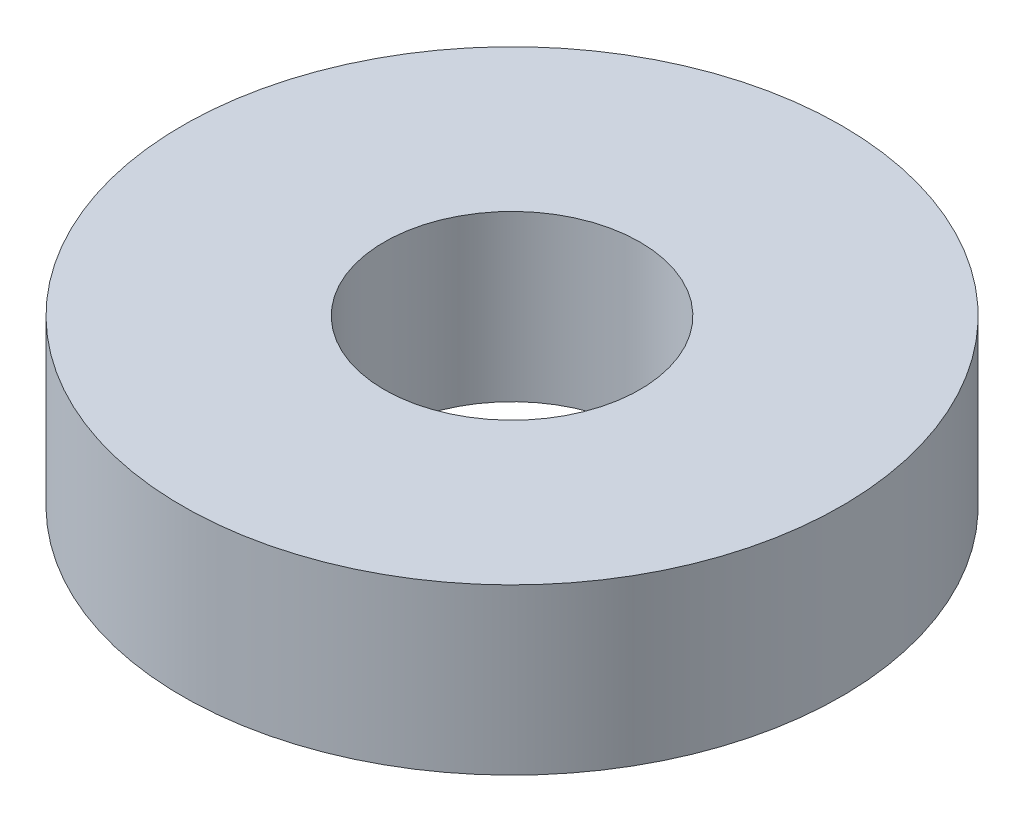
ISO-10303-21;
HEADER;
FILE_DESCRIPTION(('STEP AP214'),'2;1');
FILE_NAME('part.step','',(''),(''),'','','');
FILE_SCHEMA(('AUTOMOTIVE_DESIGN { 1 0 10303 214 1 1 1 1 }'));
ENDSEC;
DATA;
#1=APPLICATION_CONTEXT('core data for automotive mechanical design processes');
#2=APPLICATION_PROTOCOL_DEFINITION('international standard','automotive_design',2000,#1);
#3=PRODUCT_CONTEXT('',#1,'mechanical');
#4=PRODUCT('Part','Part','',(#3));
#5=PRODUCT_RELATED_PRODUCT_CATEGORY('part','',(#4));
#6=PRODUCT_DEFINITION_FORMATION('','',#4);
#7=PRODUCT_DEFINITION_CONTEXT('part definition',#1,'design');
#8=PRODUCT_DEFINITION('design','',#6,#7);
#9=PRODUCT_DEFINITION_SHAPE('','',#8);
#10=(LENGTH_UNIT() NAMED_UNIT(*) SI_UNIT(.MILLI.,.METRE.));
#11=(NAMED_UNIT(*) PLANE_ANGLE_UNIT() SI_UNIT($,.RADIAN.));
#12=(NAMED_UNIT(*) SI_UNIT($,.STERADIAN.) SOLID_ANGLE_UNIT());
#13=UNCERTAINTY_MEASURE_WITH_UNIT(LENGTH_MEASURE(1.E-05),#10,'distance_accuracy_value','');
#14=(GEOMETRIC_REPRESENTATION_CONTEXT(3) GLOBAL_UNCERTAINTY_ASSIGNED_CONTEXT((#13)) GLOBAL_UNIT_ASSIGNED_CONTEXT((#10,
#11,#12)) REPRESENTATION_CONTEXT('',''));
#15=CARTESIAN_POINT('',(0.,0.,0.));
#16=DIRECTION('',(0.,0.,1.));
#17=DIRECTION('',(1.,0.,0.));
#18=AXIS2_PLACEMENT_3D('',#15,#16,#17);
#19=CARTESIAN_POINT('',(0.,-1.5875,0.));
#20=DIRECTION('',(0.,1.,0.));
#21=DIRECTION('',(0.,0.,1.));
#22=AXIS2_PLACEMENT_3D('',#19,#20,#21);
#23=PLANE('',#22);
#24=CARTESIAN_POINT('',(0.,-1.5875,0.));
#25=DIRECTION('',(0.,-1.,0.));
#26=DIRECTION('',(0.,0.,-1.));
#27=AXIS2_PLACEMENT_3D('',#24,#25,#26);
#28=CIRCLE('',#27,2.4638);
#29=CARTESIAN_POINT('',(0.,-1.5875,-2.4638));
#30=VERTEX_POINT('',#29);
#31=EDGE_CURVE('E28',#30,#30,#28,.F.);
#32=ORIENTED_EDGE('',*,*,#31,.T.);
#33=EDGE_LOOP('',(#32));
#34=FACE_BOUND('',#33,.T.);
#35=CARTESIAN_POINT('',(0.,-1.5875,0.));
#36=DIRECTION('',(0.,-1.,0.));
#37=DIRECTION('',(0.,0.,-1.));
#38=AXIS2_PLACEMENT_3D('',#35,#36,#37);
#39=CIRCLE('',#38,6.35);
#40=CARTESIAN_POINT('',(0.,-1.5875,-6.35));
#41=VERTEX_POINT('',#40);
#42=EDGE_CURVE('E19',#41,#41,#39,.F.);
#43=ORIENTED_EDGE('',*,*,#42,.F.);
#44=EDGE_LOOP('',(#43));
#45=FACE_BOUND('',#44,.T.);
#46=ADVANCED_FACE('F16',(#34,#45),#23,.F.);
#47=CARTESIAN_POINT('',(0.,1.5875,0.));
#48=DIRECTION('',(0.,-1.,0.));
#49=DIRECTION('',(0.,0.,-1.));
#50=AXIS2_PLACEMENT_3D('',#47,#48,#49);
#51=CYLINDRICAL_SURFACE('',#50,6.35);
#52=ORIENTED_EDGE('',*,*,#42,.T.);
#53=EDGE_LOOP('',(#52));
#54=FACE_BOUND('',#53,.T.);
#55=CARTESIAN_POINT('',(0.,1.5875,0.));
#56=DIRECTION('',(0.,-1.,0.));
#57=DIRECTION('',(0.,0.,-1.));
#58=AXIS2_PLACEMENT_3D('',#55,#56,#57);
#59=CIRCLE('',#58,6.35);
#60=CARTESIAN_POINT('',(0.,1.5875,-6.35));
#61=VERTEX_POINT('',#60);
#62=EDGE_CURVE('E23',#61,#61,#59,.F.);
#63=ORIENTED_EDGE('',*,*,#62,.F.);
#64=EDGE_LOOP('',(#63));
#65=FACE_BOUND('',#64,.T.);
#66=ADVANCED_FACE('F36',(#54,#65),#51,.T.);
#67=CARTESIAN_POINT('',(0.,1.5875,0.));
#68=DIRECTION('',(0.,-1.,0.));
#69=DIRECTION('',(0.,0.,-1.));
#70=AXIS2_PLACEMENT_3D('',#67,#68,#69);
#71=CYLINDRICAL_SURFACE('',#70,2.4638);
#72=CARTESIAN_POINT('',(0.,1.5875,0.));
#73=DIRECTION('',(0.,-1.,0.));
#74=DIRECTION('',(0.,0.,-1.));
#75=AXIS2_PLACEMENT_3D('',#72,#73,#74);
#76=CIRCLE('',#75,2.4638);
#77=CARTESIAN_POINT('',(0.,1.5875,-2.4638));
#78=VERTEX_POINT('',#77);
#79=EDGE_CURVE('E10',#78,#78,#76,.T.);
#80=ORIENTED_EDGE('',*,*,#79,.F.);
#81=EDGE_LOOP('',(#80));
#82=FACE_BOUND('',#81,.T.);
#83=ORIENTED_EDGE('',*,*,#31,.F.);
#84=EDGE_LOOP('',(#83));
#85=FACE_BOUND('',#84,.T.);
#86=ADVANCED_FACE('F43',(#82,#85),#71,.F.);
#87=CARTESIAN_POINT('',(0.,1.5875,0.));
#88=DIRECTION('',(0.,1.,0.));
#89=DIRECTION('',(0.,0.,1.));
#90=AXIS2_PLACEMENT_3D('',#87,#88,#89);
#91=PLANE('',#90);
#92=ORIENTED_EDGE('',*,*,#79,.T.);
#93=EDGE_LOOP('',(#92));
#94=FACE_BOUND('',#93,.T.);
#95=ORIENTED_EDGE('',*,*,#62,.T.);
#96=EDGE_LOOP('',(#95));
#97=FACE_BOUND('',#96,.T.);
#98=ADVANCED_FACE('F44',(#94,#97),#91,.T.);
#99=CLOSED_SHELL('',(#46,#66,#86,#98));
#100=MANIFOLD_SOLID_BREP('B1',#99);
#101=ADVANCED_BREP_SHAPE_REPRESENTATION('',(#18,#100),#14);
#102=SHAPE_DEFINITION_REPRESENTATION(#9,#101);
ENDSEC;
END-ISO-10303-21;
